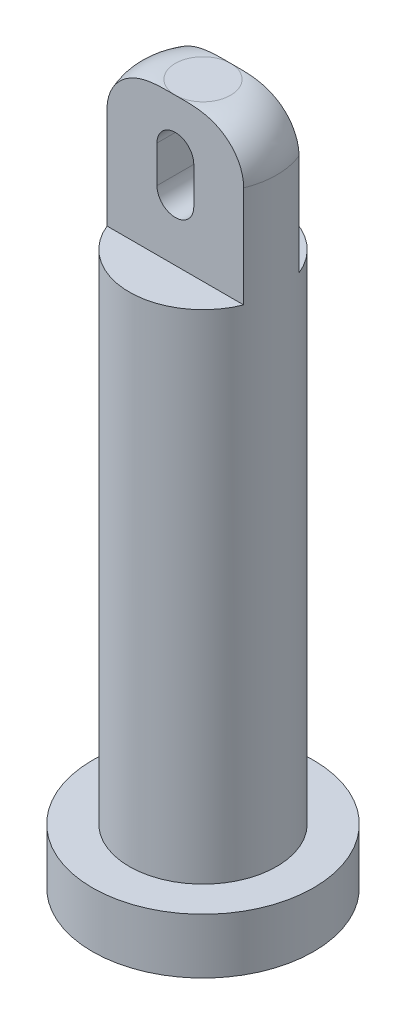
ISO-10303-21;
HEADER;
FILE_DESCRIPTION(('STEP AP214'),'2;1');
FILE_NAME('part.step','',(''),(''),'','','');
FILE_SCHEMA(('AUTOMOTIVE_DESIGN { 1 0 10303 214 1 1 1 1 }'));
ENDSEC;
DATA;
#1=APPLICATION_CONTEXT('core data for automotive mechanical design processes');
#2=APPLICATION_PROTOCOL_DEFINITION('international standard','automotive_design',2000,#1);
#3=PRODUCT_CONTEXT('',#1,'mechanical');
#4=PRODUCT('Part','Part','',(#3));
#5=PRODUCT_RELATED_PRODUCT_CATEGORY('part','',(#4));
#6=PRODUCT_DEFINITION_FORMATION('','',#4);
#7=PRODUCT_DEFINITION_CONTEXT('part definition',#1,'design');
#8=PRODUCT_DEFINITION('design','',#6,#7);
#9=PRODUCT_DEFINITION_SHAPE('','',#8);
#10=(LENGTH_UNIT() NAMED_UNIT(*) SI_UNIT(.MILLI.,.METRE.));
#11=(NAMED_UNIT(*) PLANE_ANGLE_UNIT() SI_UNIT($,.RADIAN.));
#12=(NAMED_UNIT(*) SI_UNIT($,.STERADIAN.) SOLID_ANGLE_UNIT());
#13=UNCERTAINTY_MEASURE_WITH_UNIT(LENGTH_MEASURE(1.E-05),#10,'distance_accuracy_value','');
#14=(GEOMETRIC_REPRESENTATION_CONTEXT(3) GLOBAL_UNCERTAINTY_ASSIGNED_CONTEXT((#13)) GLOBAL_UNIT_ASSIGNED_CONTEXT((#10,
#11,#12)) REPRESENTATION_CONTEXT('',''));
#15=CARTESIAN_POINT('',(0.,0.,0.));
#16=DIRECTION('',(0.,0.,1.));
#17=DIRECTION('',(1.,0.,0.));
#18=AXIS2_PLACEMENT_3D('',#15,#16,#17);
#19=CARTESIAN_POINT('',(0.,15.,0.));
#20=DIRECTION('',(0.,1.,0.));
#21=DIRECTION('',(0.,0.,1.));
#22=AXIS2_PLACEMENT_3D('',#19,#20,#21);
#23=PLANE('',#22);
#24=DIRECTION('',(-1.,0.,0.));
#25=VECTOR('',#24,1.);
#26=CARTESIAN_POINT('',(1.85404962177392,15.,-0.75));
#27=LINE('',#26,#25);
#28=CARTESIAN_POINT('',(1.85404962177392,15.,-0.75));
#29=VERTEX_POINT('',#28);
#30=CARTESIAN_POINT('',(-1.85404962177392,15.,-0.750000000000001));
#31=VERTEX_POINT('',#30);
#32=EDGE_CURVE('E161',#29,#31,#27,.T.);
#33=ORIENTED_EDGE('',*,*,#32,.F.);
#34=CARTESIAN_POINT('',(0.,15.,0.));
#35=DIRECTION('',(0.,1.,0.));
#36=DIRECTION('',(0.,0.,1.));
#37=AXIS2_PLACEMENT_3D('',#34,#35,#36);
#38=CIRCLE('',#37,2.);
#39=EDGE_CURVE('E181',#29,#31,#38,.T.);
#40=ORIENTED_EDGE('',*,*,#39,.T.);
#41=EDGE_LOOP('',(#33,#40));
#42=FACE_BOUND('',#41,.T.);
#43=ADVANCED_FACE('F39',(#42),#23,.T.);
#44=CARTESIAN_POINT('',(0.,1.5,0.));
#45=DIRECTION('',(0.,-1.,0.));
#46=DIRECTION('',(0.,0.,-1.));
#47=AXIS2_PLACEMENT_3D('',#44,#45,#46);
#48=CYLINDRICAL_SURFACE('',#47,3.);
#49=CARTESIAN_POINT('',(0.,1.5,0.));
#50=DIRECTION('',(0.,1.,0.));
#51=DIRECTION('',(0.,0.,1.));
#52=AXIS2_PLACEMENT_3D('',#49,#50,#51);
#53=CIRCLE('',#52,3.);
#54=CARTESIAN_POINT('',(0.,1.5,3.));
#55=VERTEX_POINT('',#54);
#56=EDGE_CURVE('E187',#55,#55,#53,.T.);
#57=ORIENTED_EDGE('',*,*,#56,.F.);
#58=EDGE_LOOP('',(#57));
#59=FACE_BOUND('',#58,.T.);
#60=CARTESIAN_POINT('',(0.,0.,0.));
#61=DIRECTION('',(0.,1.,0.));
#62=DIRECTION('',(0.,0.,1.));
#63=AXIS2_PLACEMENT_3D('',#60,#61,#62);
#64=CIRCLE('',#63,3.);
#65=CARTESIAN_POINT('',(0.,0.,3.));
#66=VERTEX_POINT('',#65);
#67=EDGE_CURVE('E191',#66,#66,#64,.T.);
#68=ORIENTED_EDGE('',*,*,#67,.T.);
#69=EDGE_LOOP('',(#68));
#70=FACE_BOUND('',#69,.T.);
#71=ADVANCED_FACE('F274',(#59,#70),#48,.T.);
#72=CARTESIAN_POINT('',(0.,1.5,0.));
#73=DIRECTION('',(0.,1.,0.));
#74=DIRECTION('',(0.,0.,1.));
#75=AXIS2_PLACEMENT_3D('',#72,#73,#74);
#76=PLANE('',#75);
#77=CARTESIAN_POINT('',(0.,1.5,0.));
#78=DIRECTION('',(0.,1.,0.));
#79=DIRECTION('',(0.,0.,1.));
#80=AXIS2_PLACEMENT_3D('',#77,#78,#79);
#81=CIRCLE('',#80,2.);
#82=CARTESIAN_POINT('',(0.,1.5,2.));
#83=VERTEX_POINT('',#82);
#84=EDGE_CURVE('E182',#83,#83,#81,.T.);
#85=ORIENTED_EDGE('',*,*,#84,.F.);
#86=EDGE_LOOP('',(#85));
#87=FACE_BOUND('',#86,.T.);
#88=ORIENTED_EDGE('',*,*,#56,.T.);
#89=EDGE_LOOP('',(#88));
#90=FACE_BOUND('',#89,.T.);
#91=ADVANCED_FACE('F279',(#87,#90),#76,.T.);
#92=CARTESIAN_POINT('',(0.,0.,0.));
#93=DIRECTION('',(0.,1.,0.));
#94=DIRECTION('',(0.,0.,1.));
#95=AXIS2_PLACEMENT_3D('',#92,#93,#94);
#96=PLANE('',#95);
#97=ORIENTED_EDGE('',*,*,#67,.F.);
#98=EDGE_LOOP('',(#97));
#99=FACE_BOUND('',#98,.T.);
#100=ADVANCED_FACE('F287',(#99),#96,.F.);
#101=CARTESIAN_POINT('',(0.,15.,0.));
#102=DIRECTION('',(0.,-1.,0.));
#103=DIRECTION('',(0.,0.,-1.));
#104=AXIS2_PLACEMENT_3D('',#101,#102,#103);
#105=CYLINDRICAL_SURFACE('',#104,2.);
#106=DIRECTION('',(0.,-1.,0.));
#107=VECTOR('',#106,1.);
#108=CARTESIAN_POINT('',(1.85404962177392,19.,-0.75));
#109=LINE('',#108,#107);
#110=CARTESIAN_POINT('',(1.85404962177392,17.75,-0.75));
#111=VERTEX_POINT('',#110);
#112=EDGE_CURVE('E168',#111,#29,#109,.T.);
#113=ORIENTED_EDGE('',*,*,#112,.F.);
#114=CARTESIAN_POINT('',(0.,17.75,0.));
#115=DIRECTION('',(0.,1.,0.));
#116=DIRECTION('',(0.,0.,1.));
#117=AXIS2_PLACEMENT_3D('',#114,#115,#116);
#118=CIRCLE('',#117,2.);
#119=CARTESIAN_POINT('',(1.85404962177392,17.75,0.75));
#120=VERTEX_POINT('',#119);
#121=EDGE_CURVE('E67',#111,#120,#118,.F.);
#122=ORIENTED_EDGE('',*,*,#121,.T.);
#123=DIRECTION('',(0.,-1.,0.));
#124=VECTOR('',#123,1.);
#125=CARTESIAN_POINT('',(1.85404962177392,19.,0.75));
#126=LINE('',#125,#124);
#127=CARTESIAN_POINT('',(1.85404962177392,15.,0.75));
#128=VERTEX_POINT('',#127);
#129=EDGE_CURVE('E171',#120,#128,#126,.T.);
#130=ORIENTED_EDGE('',*,*,#129,.T.);
#131=CARTESIAN_POINT('',(-1.85404962177392,15.,0.750000000000001));
#132=VERTEX_POINT('',#131);
#133=EDGE_CURVE('E177',#132,#128,#38,.T.);
#134=ORIENTED_EDGE('',*,*,#133,.F.);
#135=DIRECTION('',(0.,-1.,0.));
#136=VECTOR('',#135,1.);
#137=CARTESIAN_POINT('',(-1.85404962177392,19.,0.750000000000001));
#138=LINE('',#137,#136);
#139=CARTESIAN_POINT('',(-1.85404962177392,17.75,0.750000000000001));
#140=VERTEX_POINT('',#139);
#141=EDGE_CURVE('E174',#140,#132,#138,.T.);
#142=ORIENTED_EDGE('',*,*,#141,.F.);
#143=CARTESIAN_POINT('',(0.,17.75,0.));
#144=DIRECTION('',(0.,1.,0.));
#145=DIRECTION('',(0.,0.,1.));
#146=AXIS2_PLACEMENT_3D('',#143,#144,#145);
#147=CIRCLE('',#146,2.);
#148=CARTESIAN_POINT('',(-1.85404962177392,17.75,-0.750000000000001));
#149=VERTEX_POINT('',#148);
#150=EDGE_CURVE('E250',#140,#149,#147,.F.);
#151=ORIENTED_EDGE('',*,*,#150,.T.);
#152=DIRECTION('',(0.,-1.,0.));
#153=VECTOR('',#152,1.);
#154=CARTESIAN_POINT('',(-1.85404962177392,19.,-0.750000000000001));
#155=LINE('',#154,#153);
#156=EDGE_CURVE('E165',#149,#31,#155,.T.);
#157=ORIENTED_EDGE('',*,*,#156,.T.);
#158=ORIENTED_EDGE('',*,*,#39,.F.);
#159=EDGE_LOOP('',(#113,#122,#130,#134,#142,#151,#157,#158));
#160=FACE_BOUND('',#159,.T.);
#161=ORIENTED_EDGE('',*,*,#84,.T.);
#162=EDGE_LOOP('',(#161));
#163=FACE_BOUND('',#162,.T.);
#164=ADVANCED_FACE('F261',(#160,#163),#105,.T.);
#165=DIRECTION('',(1.,0.,0.));
#166=VECTOR('',#165,1.);
#167=CARTESIAN_POINT('',(1.85404962177392,15.,0.75));
#168=LINE('',#167,#166);
#169=EDGE_CURVE('E153',#132,#128,#168,.T.);
#170=ORIENTED_EDGE('',*,*,#169,.F.);
#171=ORIENTED_EDGE('',*,*,#133,.T.);
#172=EDGE_LOOP('',(#170,#171));
#173=FACE_BOUND('',#172,.T.);
#174=ADVANCED_FACE('F240',(#173),#23,.T.);
#175=CARTESIAN_POINT('',(1.85404962177392,19.,0.75));
#176=DIRECTION('',(0.,0.,-1.));
#177=DIRECTION('',(-1.,0.,0.));
#178=AXIS2_PLACEMENT_3D('',#175,#176,#177);
#179=PLANE('',#178);
#180=DIRECTION('',(0.,1.,0.));
#181=VECTOR('',#180,1.);
#182=CARTESIAN_POINT('',(0.5,16.6267135097319,0.750000000000001));
#183=LINE('',#182,#181);
#184=CARTESIAN_POINT('',(0.5,16.6267135097319,0.75));
#185=VERTEX_POINT('',#184);
#186=CARTESIAN_POINT('',(0.5,17.6267135097319,0.750000000000001));
#187=VERTEX_POINT('',#186);
#188=EDGE_CURVE('E133',#185,#187,#183,.T.);
#189=ORIENTED_EDGE('',*,*,#188,.F.);
#190=CARTESIAN_POINT('',(0.,16.6267135097319,0.750000000000001));
#191=DIRECTION('',(0.,0.,1.));
#192=DIRECTION('',(1.,0.,0.));
#193=AXIS2_PLACEMENT_3D('',#190,#191,#192);
#194=CIRCLE('',#193,0.5);
#195=CARTESIAN_POINT('',(-0.5,16.6267135097319,0.750000000000001));
#196=VERTEX_POINT('',#195);
#197=EDGE_CURVE('E139',#196,#185,#194,.T.);
#198=ORIENTED_EDGE('',*,*,#197,.F.);
#199=DIRECTION('',(0.,1.,0.));
#200=VECTOR('',#199,1.);
#201=CARTESIAN_POINT('',(-0.5,16.6267135097319,0.750000000000001));
#202=LINE('',#201,#200);
#203=CARTESIAN_POINT('',(-0.5,17.6267135097319,0.750000000000001));
#204=VERTEX_POINT('',#203);
#205=EDGE_CURVE('E143',#196,#204,#202,.T.);
#206=ORIENTED_EDGE('',*,*,#205,.T.);
#207=CARTESIAN_POINT('',(0.,17.6267135097319,0.750000000000001));
#208=DIRECTION('',(0.,0.,1.));
#209=DIRECTION('',(1.,0.,0.));
#210=AXIS2_PLACEMENT_3D('',#207,#208,#209);
#211=CIRCLE('',#210,0.5);
#212=EDGE_CURVE('E121',#187,#204,#211,.T.);
#213=ORIENTED_EDGE('',*,*,#212,.F.);
#214=EDGE_LOOP('',(#189,#198,#206,#213));
#215=FACE_BOUND('',#214,.T.);
#216=ORIENTED_EDGE('',*,*,#129,.F.);
#217=CARTESIAN_POINT('',(1.85404962177392,17.75,0.75));
#218=CARTESIAN_POINT('',(1.85404987609965,17.7829202713449,0.75));
#219=CARTESIAN_POINT('',(1.85264582524709,17.8158245031956,0.75));
#220=CARTESIAN_POINT('',(1.8470478212003,17.8813912784331,0.75));
#221=CARTESIAN_POINT('',(1.84285416377596,17.9140538470714,0.75));
#222=CARTESIAN_POINT('',(1.82615135626441,18.0111718865846,0.75));
#223=CARTESIAN_POINT('',(1.80952008552678,18.0749665708583,0.75));
#224=CARTESIAN_POINT('',(1.76580137266379,18.1988362144143,0.75));
#225=CARTESIAN_POINT('',(1.73871199916582,18.2589104842418,0.75));
#226=CARTESIAN_POINT('',(1.67494417721853,18.3737805919275,0.75));
#227=CARTESIAN_POINT('',(1.63825967812593,18.428573069167,0.75));
#228=CARTESIAN_POINT('',(1.55590076165501,18.5321932765915,0.75));
#229=CARTESIAN_POINT('',(1.51010582621351,18.5809250145161,0.75));
#230=CARTESIAN_POINT('',(1.41142142190987,18.6703552293072,0.75));
#231=CARTESIAN_POINT('',(1.35854345701286,18.7110664732296,0.75));
#232=CARTESIAN_POINT('',(1.24445371138517,18.7857316825814,0.75));
#233=CARTESIAN_POINT('',(1.18296011174497,18.8192553509936,0.75));
#234=CARTESIAN_POINT('',(1.0873832025159,18.8624645839737,0.75));
#235=CARTESIAN_POINT('',(1.05485402544452,18.8757205317472,0.75));
#236=CARTESIAN_POINT('',(0.988959456332797,18.8998865744184,0.75));
#237=CARTESIAN_POINT('',(0.955594630067169,18.9107982110184,0.75));
#238=CARTESIAN_POINT('',(0.846937006096045,18.9423548907243,0.75));
#239=CARTESIAN_POINT('',(0.770325711144289,18.9585596827591,0.75));
#240=CARTESIAN_POINT('',(0.654344102262755,18.9760739641802,0.75));
#241=CARTESIAN_POINT('',(0.615406238856336,18.9807831402856,0.75));
#242=CARTESIAN_POINT('',(0.537346652034885,18.9883273971192,0.75));
#243=CARTESIAN_POINT('',(0.498224940035551,18.9911625926995,0.75));
#244=CARTESIAN_POINT('',(0.42066312877152,18.9953769174529,0.75));
#245=CARTESIAN_POINT('',(0.382224311517943,18.9967828708924,0.75));
#246=CARTESIAN_POINT('',(0.305323166038632,18.9987090357806,0.75));
#247=CARTESIAN_POINT('',(0.266860835740387,18.9992291526171,0.750000000000001));
#248=CARTESIAN_POINT('',(0.190324764229554,18.9998424198733,0.750000000000001));
#249=CARTESIAN_POINT('',(0.152251039435805,18.9999398484135,0.750000000000001));
#250=CARTESIAN_POINT('',(0.0761180349051342,19.0000004032824,0.750000000000001));
#251=CARTESIAN_POINT('',(0.0380587552732844,18.9999635815091,0.750000000000001));
#252=CARTESIAN_POINT('',(0.,19.,0.750000000000001));
#253=B_SPLINE_CURVE_WITH_KNOTS('',3,(#217,#218,#219,#220,#221,#222,#223,#224,#225,#226,#227,
#228,#229,#230,#231,#232,#233,#234,#235,#236,#237,#238,#239,#240,#241,#242,#243,#244,#245,#246,
#247,#248,#249,#250,#251,#252),.UNSPECIFIED.,.F.,.F.,(4,2,2,2,2,2,2,2,2,2,2,2,2,2,2,2,2,4),(0.,
0.098699157085795,0.19738785119555,0.394146709354992,0.590941921775617,0.787861532828483,
0.987583802546193,1.1869855381523,1.39618471288919,1.50148905287898,1.60672392756371,
1.84080587689589,1.95844367987051,2.07607427241907,2.19145395664903,2.30684596327844,
2.42106729660347,2.53524447921184),.UNSPECIFIED.);
#254=CARTESIAN_POINT('',(0.,19.,0.750000000000001));
#255=VERTEX_POINT('',#254);
#256=EDGE_CURVE('E11',#120,#255,#253,.T.);
#257=ORIENTED_EDGE('',*,*,#256,.T.);
#258=CARTESIAN_POINT('',(0.,19.,0.75));
#259=CARTESIAN_POINT('',(-0.0309324587635021,18.9999830733028,0.75));
#260=CARTESIAN_POINT('',(-0.0618648252228304,18.9999998748047,0.750000000000001));
#261=CARTESIAN_POINT('',(-0.123732633537502,18.9999739575338,0.750000000000001));
#262=CARTESIAN_POINT('',(-0.154668075386177,18.9999312327168,0.750000000000001));
#263=CARTESIAN_POINT('',(-0.21667874599704,18.9996586237015,0.750000000000001));
#264=CARTESIAN_POINT('',(-0.247753975000491,18.9994278949874,0.750000000000001));
#265=CARTESIAN_POINT('',(-0.309897607848807,18.9985590860506,0.750000000000001));
#266=CARTESIAN_POINT('',(-0.340966011731963,18.9979210081748,0.750000000000001));
#267=CARTESIAN_POINT('',(-0.43539472752178,18.994983462875,0.750000000000001));
#268=CARTESIAN_POINT('',(-0.49873738747733,18.9916463196406,0.750000000000001));
#269=CARTESIAN_POINT('',(-0.624897338253877,18.9801927680681,0.750000000000001));
#270=CARTESIAN_POINT('',(-0.687715428876033,18.9720859745775,0.750000000000001));
#271=CARTESIAN_POINT('',(-0.829541678737662,18.9463434202889,0.750000000000001));
#272=CARTESIAN_POINT('',(-0.908213238089949,18.9266898154465,0.750000000000001));
#273=CARTESIAN_POINT('',(-1.06101497406091,18.875156105972,0.750000000000001));
#274=CARTESIAN_POINT('',(-1.13516994086357,18.8433513669252,0.750000000000001));
#275=CARTESIAN_POINT('',(-1.27745460426262,18.7666170857837,0.750000000000001));
#276=CARTESIAN_POINT('',(-1.3455121744621,18.721552114855,0.750000000000001));
#277=CARTESIAN_POINT('',(-1.47184657717201,18.6190601540145,0.750000000000001));
#278=CARTESIAN_POINT('',(-1.53010821743849,18.561614272008,0.750000000000001));
#279=CARTESIAN_POINT('',(-1.62772757344654,18.4437510281014,0.750000000000001));
#280=CARTESIAN_POINT('',(-1.66851342252159,18.3845128188054,0.750000000000001));
#281=CARTESIAN_POINT('',(-1.73870277238908,18.2597032513702,0.750000000000001));
#282=CARTESIAN_POINT('',(-1.76811953343881,18.1941393833848,0.750000000000001));
#283=CARTESIAN_POINT('',(-1.81198324669458,18.0660222921792,0.750000000000001));
#284=CARTESIAN_POINT('',(-1.82770054388861,18.0039044295716,0.750000000000001));
#285=CARTESIAN_POINT('',(-1.84347869813347,17.9094277731023,0.750000000000001));
#286=CARTESIAN_POINT('',(-1.84743850164149,17.8776797642293,0.750000000000001));
#287=CARTESIAN_POINT('',(-1.85272458092874,17.8139590511535,0.750000000000001));
#288=CARTESIAN_POINT('',(-1.8540503432816,17.7819863043634,0.750000000000001));
#289=CARTESIAN_POINT('',(-1.85404962177392,17.75,0.750000000000001));
#290=B_SPLINE_CURVE_WITH_KNOTS('',3,(#258,#259,#260,#261,#262,#263,#264,#265,#266,#267,#268,
#269,#270,#271,#272,#273,#274,#275,#276,#277,#278,#279,#280,#281,#282,#283,#284,#285,#286,#287,
#288,#289),.UNSPECIFIED.,.F.,.F.,(4,2,2,2,2,2,2,2,2,2,2,2,2,2,2,4),(0.,0.0927971597697559,
0.185603742751774,0.2788295273985,0.372054774911579,0.562227504985328,0.752018184592486,
0.994393928573584,1.23529015734402,1.47873755477438,1.72255909364316,1.93718970287777,
2.15156921823012,2.34287718579002,2.43876314577931,2.53466779399256),.UNSPECIFIED.);
#291=EDGE_CURVE('E54',#255,#140,#290,.T.);
#292=ORIENTED_EDGE('',*,*,#291,.T.);
#293=ORIENTED_EDGE('',*,*,#141,.T.);
#294=ORIENTED_EDGE('',*,*,#169,.T.);
#295=EDGE_LOOP('',(#216,#257,#292,#293,#294));
#296=FACE_BOUND('',#295,.T.);
#297=ADVANCED_FACE('F141',(#215,#296),#179,.F.);
#298=CARTESIAN_POINT('',(1.85404962177392,19.,-0.75));
#299=DIRECTION('',(0.,0.,1.));
#300=DIRECTION('',(1.,0.,0.));
#301=AXIS2_PLACEMENT_3D('',#298,#299,#300);
#302=PLANE('',#301);
#303=DIRECTION('',(0.,1.,0.));
#304=VECTOR('',#303,1.);
#305=CARTESIAN_POINT('',(-0.5,19.,-0.75));
#306=LINE('',#305,#304);
#307=CARTESIAN_POINT('',(-0.5,16.6267135097319,-0.75));
#308=VERTEX_POINT('',#307);
#309=CARTESIAN_POINT('',(-0.5,17.6267135097319,-0.75));
#310=VERTEX_POINT('',#309);
#311=EDGE_CURVE('E199',#308,#310,#306,.T.);
#312=ORIENTED_EDGE('',*,*,#311,.F.);
#313=CARTESIAN_POINT('',(0.,16.6267135097319,-0.75));
#314=DIRECTION('',(0.,0.,1.));
#315=DIRECTION('',(1.,0.,0.));
#316=AXIS2_PLACEMENT_3D('',#313,#314,#315);
#317=CIRCLE('',#316,0.5);
#318=CARTESIAN_POINT('',(0.5,16.6267135097319,-0.75));
#319=VERTEX_POINT('',#318);
#320=EDGE_CURVE('E202',#308,#319,#317,.T.);
#321=ORIENTED_EDGE('',*,*,#320,.T.);
#322=DIRECTION('',(0.,1.,0.));
#323=VECTOR('',#322,1.);
#324=CARTESIAN_POINT('',(0.500000000000001,19.,-0.75));
#325=LINE('',#324,#323);
#326=CARTESIAN_POINT('',(0.5,17.6267135097319,-0.75));
#327=VERTEX_POINT('',#326);
#328=EDGE_CURVE('E186',#319,#327,#325,.T.);
#329=ORIENTED_EDGE('',*,*,#328,.T.);
#330=CARTESIAN_POINT('',(0.,17.6267135097319,-0.75));
#331=DIRECTION('',(0.,0.,1.));
#332=DIRECTION('',(1.,0.,0.));
#333=AXIS2_PLACEMENT_3D('',#330,#331,#332);
#334=CIRCLE('',#333,0.5);
#335=EDGE_CURVE('E124',#327,#310,#334,.T.);
#336=ORIENTED_EDGE('',*,*,#335,.T.);
#337=EDGE_LOOP('',(#312,#321,#329,#336));
#338=FACE_BOUND('',#337,.T.);
#339=CARTESIAN_POINT('',(-1.85404962177392,17.75,-0.750000000000001));
#340=CARTESIAN_POINT('',(-1.85404987609965,17.7829202713449,-0.750000000000001));
#341=CARTESIAN_POINT('',(-1.85264582524709,17.8158245031956,-0.750000000000001));
#342=CARTESIAN_POINT('',(-1.8470478212003,17.8813912784331,-0.750000000000001));
#343=CARTESIAN_POINT('',(-1.84285416377596,17.9140538470714,-0.750000000000001));
#344=CARTESIAN_POINT('',(-1.82615135626441,18.0111718865846,-0.750000000000001));
#345=CARTESIAN_POINT('',(-1.80952008552678,18.0749665708583,-0.750000000000001));
#346=CARTESIAN_POINT('',(-1.76580137266379,18.1988362144143,-0.750000000000001));
#347=CARTESIAN_POINT('',(-1.73871199916582,18.2589104842418,-0.750000000000001));
#348=CARTESIAN_POINT('',(-1.67494417721853,18.3737805919275,-0.750000000000001));
#349=CARTESIAN_POINT('',(-1.63825967812593,18.428573069167,-0.750000000000001));
#350=CARTESIAN_POINT('',(-1.55590076165501,18.5321932765915,-0.750000000000001));
#351=CARTESIAN_POINT('',(-1.51010582621351,18.5809250145161,-0.750000000000001));
#352=CARTESIAN_POINT('',(-1.41142142190987,18.6703552293072,-0.750000000000001));
#353=CARTESIAN_POINT('',(-1.35854345701286,18.7110664732296,-0.750000000000001));
#354=CARTESIAN_POINT('',(-1.24445371138517,18.7857316825814,-0.750000000000001));
#355=CARTESIAN_POINT('',(-1.18296011174497,18.8192553509936,-0.750000000000001));
#356=CARTESIAN_POINT('',(-1.0873832025159,18.8624645839737,-0.750000000000001));
#357=CARTESIAN_POINT('',(-1.05485402544452,18.8757205317472,-0.75));
#358=CARTESIAN_POINT('',(-0.988959456332795,18.8998865744184,-0.75));
#359=CARTESIAN_POINT('',(-0.955594630067167,18.9107982110184,-0.75));
#360=CARTESIAN_POINT('',(-0.846937006096044,18.9423548907243,-0.75));
#361=CARTESIAN_POINT('',(-0.770325711144287,18.9585596827591,-0.75));
#362=CARTESIAN_POINT('',(-0.654344102262754,18.9760739641802,-0.75));
#363=CARTESIAN_POINT('',(-0.615406238856334,18.9807831402856,-0.75));
#364=CARTESIAN_POINT('',(-0.537346652034884,18.9883273971192,-0.75));
#365=CARTESIAN_POINT('',(-0.49822494003555,18.9911625926995,-0.75));
#366=CARTESIAN_POINT('',(-0.42066312877152,18.9953769174529,-0.75));
#367=CARTESIAN_POINT('',(-0.382224311517943,18.9967828708924,-0.75));
#368=CARTESIAN_POINT('',(-0.305323166038632,18.9987090357806,-0.75));
#369=CARTESIAN_POINT('',(-0.266860835740387,18.9992291526171,-0.75));
#370=CARTESIAN_POINT('',(-0.190324764229554,18.9998424198733,-0.75));
#371=CARTESIAN_POINT('',(-0.152251039435804,18.9999398484135,-0.75));
#372=CARTESIAN_POINT('',(-0.0761180349051339,19.0000004032824,-0.75));
#373=CARTESIAN_POINT('',(-0.0380587552732843,18.9999635815091,-0.75));
#374=CARTESIAN_POINT('',(0.,19.,-0.75));
#375=B_SPLINE_CURVE_WITH_KNOTS('',3,(#339,#340,#341,#342,#343,#344,#345,#346,#347,#348,#349,
#350,#351,#352,#353,#354,#355,#356,#357,#358,#359,#360,#361,#362,#363,#364,#365,#366,#367,#368,
#369,#370,#371,#372,#373,#374),.UNSPECIFIED.,.F.,.F.,(4,2,2,2,2,2,2,2,2,2,2,2,2,2,2,2,2,4),(0.,
0.098699157085795,0.19738785119555,0.394146709354992,0.590941921775617,0.787861532828483,
0.987583802546193,1.1869855381523,1.39618471288919,1.50148905287898,1.60672392756372,
1.8408058768959,1.95844367987051,2.07607427241907,2.19145395664903,2.30684596327844,
2.42106729660347,2.53524447921184),.UNSPECIFIED.);
#376=CARTESIAN_POINT('',(0.,19.,-0.75));
#377=VERTEX_POINT('',#376);
#378=EDGE_CURVE('E214',#149,#377,#375,.T.);
#379=ORIENTED_EDGE('',*,*,#378,.T.);
#380=CARTESIAN_POINT('',(0.,19.,-0.75));
#381=CARTESIAN_POINT('',(0.0309324587635025,18.9999830733028,-0.75));
#382=CARTESIAN_POINT('',(0.0618648252228308,18.9999998748047,-0.75));
#383=CARTESIAN_POINT('',(0.123732633537503,18.9999739575338,-0.75));
#384=CARTESIAN_POINT('',(0.154668075386177,18.9999312327168,-0.75));
#385=CARTESIAN_POINT('',(0.21667874599704,18.9996586237015,-0.75));
#386=CARTESIAN_POINT('',(0.247753975000492,18.9994278949874,-0.75));
#387=CARTESIAN_POINT('',(0.309897607848807,18.9985590860506,-0.75));
#388=CARTESIAN_POINT('',(0.340966011731964,18.9979210081748,-0.75));
#389=CARTESIAN_POINT('',(0.43539472752178,18.994983462875,-0.75));
#390=CARTESIAN_POINT('',(0.498737387477331,18.9916463196406,-0.75));
#391=CARTESIAN_POINT('',(0.624897338253878,18.9801927680681,-0.75));
#392=CARTESIAN_POINT('',(0.687715428876033,18.9720859745775,-0.75));
#393=CARTESIAN_POINT('',(0.829541678737662,18.9463434202889,-0.75));
#394=CARTESIAN_POINT('',(0.90821323808995,18.9266898154465,-0.75));
#395=CARTESIAN_POINT('',(1.06101497406091,18.875156105972,-0.75));
#396=CARTESIAN_POINT('',(1.13516994086357,18.8433513669252,-0.75));
#397=CARTESIAN_POINT('',(1.27745460426262,18.7666170857837,-0.75));
#398=CARTESIAN_POINT('',(1.3455121744621,18.721552114855,-0.75));
#399=CARTESIAN_POINT('',(1.47184657717201,18.6190601540145,-0.75));
#400=CARTESIAN_POINT('',(1.53010821743849,18.561614272008,-0.75));
#401=CARTESIAN_POINT('',(1.62772757344654,18.4437510281014,-0.75));
#402=CARTESIAN_POINT('',(1.66851342252159,18.3845128188054,-0.75));
#403=CARTESIAN_POINT('',(1.73870277238908,18.2597032513702,-0.75));
#404=CARTESIAN_POINT('',(1.76811953343881,18.1941393833848,-0.75));
#405=CARTESIAN_POINT('',(1.81198324669458,18.0660222921792,-0.75));
#406=CARTESIAN_POINT('',(1.82770054388862,18.0039044295716,-0.75));
#407=CARTESIAN_POINT('',(1.84347869813347,17.9094277731023,-0.75));
#408=CARTESIAN_POINT('',(1.84743850164149,17.8776797642293,-0.75));
#409=CARTESIAN_POINT('',(1.85272458092874,17.8139590511535,-0.75));
#410=CARTESIAN_POINT('',(1.8540503432816,17.7819863043634,-0.75));
#411=CARTESIAN_POINT('',(1.85404962177392,17.75,-0.75));
#412=B_SPLINE_CURVE_WITH_KNOTS('',3,(#380,#381,#382,#383,#384,#385,#386,#387,#388,#389,#390,
#391,#392,#393,#394,#395,#396,#397,#398,#399,#400,#401,#402,#403,#404,#405,#406,#407,#408,#409,
#410,#411),.UNSPECIFIED.,.F.,.F.,(4,2,2,2,2,2,2,2,2,2,2,2,2,2,2,4),(0.,0.0927971597697558,
0.185603742751774,0.2788295273985,0.372054774911579,0.562227504985328,0.752018184592486,
0.994393928573584,1.23529015734402,1.47873755477438,1.72255909364316,1.93718970287777,
2.15156921823012,2.34287718579002,2.43876314577931,2.53466779399256),.UNSPECIFIED.);
#413=EDGE_CURVE('E223',#377,#111,#412,.T.);
#414=ORIENTED_EDGE('',*,*,#413,.T.);
#415=ORIENTED_EDGE('',*,*,#112,.T.);
#416=ORIENTED_EDGE('',*,*,#32,.T.);
#417=ORIENTED_EDGE('',*,*,#156,.F.);
#418=EDGE_LOOP('',(#379,#414,#415,#416,#417));
#419=FACE_BOUND('',#418,.T.);
#420=ADVANCED_FACE('F229',(#338,#419),#302,.F.);
#421=CARTESIAN_POINT('',(0.,19.,0.));
#422=DIRECTION('',(0.,1.,0.));
#423=DIRECTION('',(0.,0.,1.));
#424=AXIS2_PLACEMENT_3D('',#421,#422,#423);
#425=PLANE('',#424);
#426=CARTESIAN_POINT('',(0.,19.,0.));
#427=DIRECTION('',(0.,1.,0.));
#428=DIRECTION('',(0.,0.,1.));
#429=AXIS2_PLACEMENT_3D('',#426,#427,#428);
#430=CIRCLE('',#429,0.75);
#431=EDGE_CURVE('E206',#377,#255,#430,.T.);
#432=ORIENTED_EDGE('',*,*,#431,.T.);
#433=CARTESIAN_POINT('',(0.,19.,0.));
#434=DIRECTION('',(0.,1.,0.));
#435=DIRECTION('',(0.,0.,1.));
#436=AXIS2_PLACEMENT_3D('',#433,#434,#435);
#437=CIRCLE('',#436,0.75);
#438=EDGE_CURVE('E210',#255,#377,#437,.T.);
#439=ORIENTED_EDGE('',*,*,#438,.T.);
#440=EDGE_LOOP('',(#432,#439));
#441=FACE_BOUND('',#440,.T.);
#442=ADVANCED_FACE('F233',(#441),#425,.T.);
#443=CARTESIAN_POINT('',(0.,16.6267135097319,-2.25));
#444=DIRECTION('',(0.,0.,1.));
#445=DIRECTION('',(1.,0.,0.));
#446=AXIS2_PLACEMENT_3D('',#443,#444,#445);
#447=CYLINDRICAL_SURFACE('',#446,0.5);
#448=DIRECTION('',(0.,0.,1.));
#449=VECTOR('',#448,1.);
#450=CARTESIAN_POINT('',(-0.5,16.6267135097319,-2.25));
#451=LINE('',#450,#449);
#452=EDGE_CURVE('E150',#308,#196,#451,.T.);
#453=ORIENTED_EDGE('',*,*,#452,.T.);
#454=ORIENTED_EDGE('',*,*,#197,.T.);
#455=DIRECTION('',(0.,0.,1.));
#456=VECTOR('',#455,1.);
#457=CARTESIAN_POINT('',(0.5,16.6267135097319,-2.25));
#458=LINE('',#457,#456);
#459=EDGE_CURVE('E129',#319,#185,#458,.T.);
#460=ORIENTED_EDGE('',*,*,#459,.F.);
#461=ORIENTED_EDGE('',*,*,#320,.F.);
#462=EDGE_LOOP('',(#453,#454,#460,#461));
#463=FACE_BOUND('',#462,.T.);
#464=ADVANCED_FACE('F339',(#463),#447,.F.);
#465=CARTESIAN_POINT('',(-0.5,16.6267135097319,-2.25));
#466=DIRECTION('',(1.,0.,0.));
#467=DIRECTION('',(0.,0.,-1.));
#468=AXIS2_PLACEMENT_3D('',#465,#466,#467);
#469=PLANE('',#468);
#470=ORIENTED_EDGE('',*,*,#311,.T.);
#471=DIRECTION('',(0.,0.,1.));
#472=VECTOR('',#471,1.);
#473=CARTESIAN_POINT('',(-0.5,17.6267135097319,-2.25));
#474=LINE('',#473,#472);
#475=EDGE_CURVE('E128',#310,#204,#474,.T.);
#476=ORIENTED_EDGE('',*,*,#475,.T.);
#477=ORIENTED_EDGE('',*,*,#205,.F.);
#478=ORIENTED_EDGE('',*,*,#452,.F.);
#479=EDGE_LOOP('',(#470,#476,#477,#478));
#480=FACE_BOUND('',#479,.T.);
#481=ADVANCED_FACE('F344',(#480),#469,.T.);
#482=CARTESIAN_POINT('',(0.,17.6267135097319,-2.25));
#483=DIRECTION('',(0.,0.,1.));
#484=DIRECTION('',(1.,0.,0.));
#485=AXIS2_PLACEMENT_3D('',#482,#483,#484);
#486=CYLINDRICAL_SURFACE('',#485,0.5);
#487=DIRECTION('',(0.,0.,1.));
#488=VECTOR('',#487,1.);
#489=CARTESIAN_POINT('',(0.5,17.6267135097319,-2.25));
#490=LINE('',#489,#488);
#491=EDGE_CURVE('E116',#327,#187,#490,.T.);
#492=ORIENTED_EDGE('',*,*,#491,.T.);
#493=ORIENTED_EDGE('',*,*,#212,.T.);
#494=ORIENTED_EDGE('',*,*,#475,.F.);
#495=ORIENTED_EDGE('',*,*,#335,.F.);
#496=EDGE_LOOP('',(#492,#493,#494,#495));
#497=FACE_BOUND('',#496,.T.);
#498=ADVANCED_FACE('F118',(#497),#486,.F.);
#499=CARTESIAN_POINT('',(0.5,16.6267135097319,-2.25));
#500=DIRECTION('',(1.,0.,0.));
#501=DIRECTION('',(0.,1.,0.));
#502=AXIS2_PLACEMENT_3D('',#499,#500,#501);
#503=PLANE('',#502);
#504=ORIENTED_EDGE('',*,*,#459,.T.);
#505=ORIENTED_EDGE('',*,*,#188,.T.);
#506=ORIENTED_EDGE('',*,*,#491,.F.);
#507=ORIENTED_EDGE('',*,*,#328,.F.);
#508=EDGE_LOOP('',(#504,#505,#506,#507));
#509=FACE_BOUND('',#508,.T.);
#510=ADVANCED_FACE('F134',(#509),#503,.F.);
#511=CARTESIAN_POINT('',(0.,17.75,0.));
#512=DIRECTION('',(0.,1.,0.));
#513=DIRECTION('',(0.,0.,1.));
#514=AXIS2_PLACEMENT_3D('',#511,#512,#513);
#515=DEGENERATE_TOROIDAL_SURFACE('',#514,0.75,1.25,.T.);
#516=ORIENTED_EDGE('',*,*,#256,.F.);
#517=ORIENTED_EDGE('',*,*,#121,.F.);
#518=ORIENTED_EDGE('',*,*,#413,.F.);
#519=ORIENTED_EDGE('',*,*,#438,.F.);
#520=EDGE_LOOP('',(#516,#517,#518,#519));
#521=FACE_BOUND('',#520,.T.);
#522=ADVANCED_FACE('F265',(#521),#515,.T.);
#523=CARTESIAN_POINT('',(0.,17.75,0.));
#524=DIRECTION('',(0.,1.,0.));
#525=DIRECTION('',(0.,0.,1.));
#526=AXIS2_PLACEMENT_3D('',#523,#524,#525);
#527=DEGENERATE_TOROIDAL_SURFACE('',#526,0.75,1.25,.T.);
#528=ORIENTED_EDGE('',*,*,#378,.F.);
#529=ORIENTED_EDGE('',*,*,#150,.F.);
#530=ORIENTED_EDGE('',*,*,#291,.F.);
#531=ORIENTED_EDGE('',*,*,#431,.F.);
#532=EDGE_LOOP('',(#528,#529,#530,#531));
#533=FACE_BOUND('',#532,.T.);
#534=ADVANCED_FACE('F41',(#533),#527,.T.);
#535=CLOSED_SHELL('',(#43,#71,#91,#100,#164,#174,#297,#420,#442,#464,#481,#498,#510,#522,#534));
#536=MANIFOLD_SOLID_BREP('B2',#535);
#537=ADVANCED_BREP_SHAPE_REPRESENTATION('',(#18,#536),#14);
#538=SHAPE_DEFINITION_REPRESENTATION(#9,#537);
ENDSEC;
END-ISO-10303-21;
